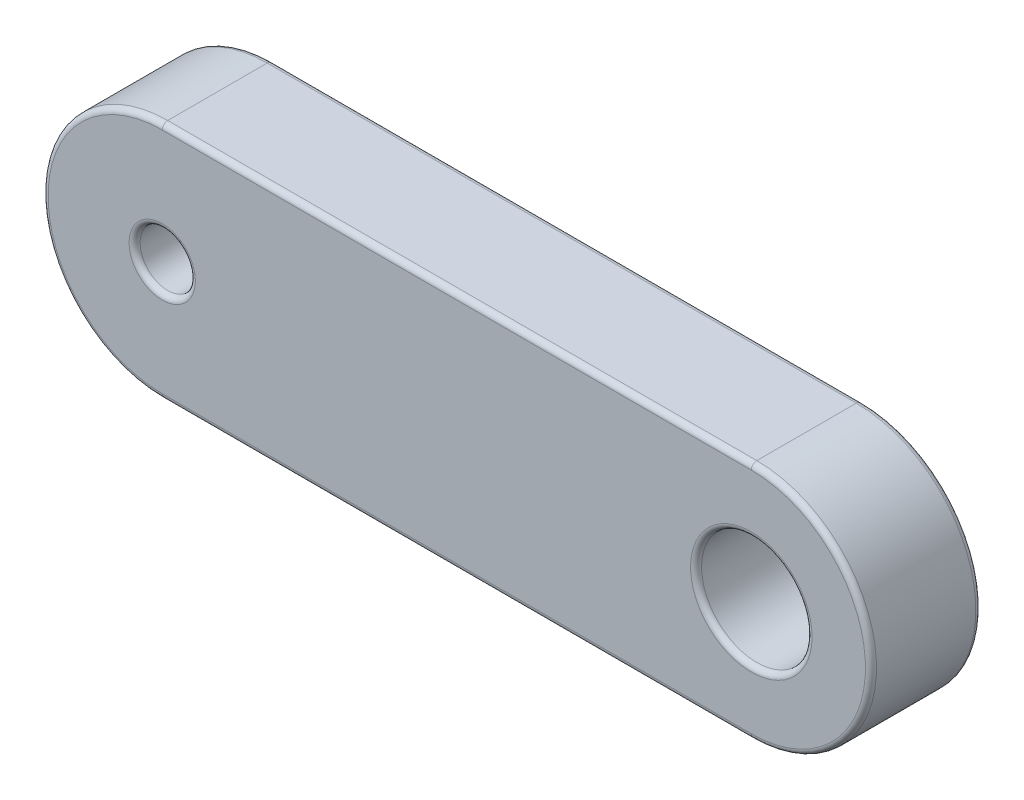
ISO-10303-21;
HEADER;
FILE_DESCRIPTION(('STEP AP214'),'2;1');
FILE_NAME('part.step','',(''),(''),'','','');
FILE_SCHEMA(('AUTOMOTIVE_DESIGN { 1 0 10303 214 1 1 1 1 }'));
ENDSEC;
DATA;
#1=APPLICATION_CONTEXT('core data for automotive mechanical design processes');
#2=APPLICATION_PROTOCOL_DEFINITION('international standard','automotive_design',2000,#1);
#3=PRODUCT_CONTEXT('',#1,'mechanical');
#4=PRODUCT('Part','Part','',(#3));
#5=PRODUCT_RELATED_PRODUCT_CATEGORY('part','',(#4));
#6=PRODUCT_DEFINITION_FORMATION('','',#4);
#7=PRODUCT_DEFINITION_CONTEXT('part definition',#1,'design');
#8=PRODUCT_DEFINITION('design','',#6,#7);
#9=PRODUCT_DEFINITION_SHAPE('','',#8);
#10=(LENGTH_UNIT() NAMED_UNIT(*) SI_UNIT(.MILLI.,.METRE.));
#11=(NAMED_UNIT(*) PLANE_ANGLE_UNIT() SI_UNIT($,.RADIAN.));
#12=(NAMED_UNIT(*) SI_UNIT($,.STERADIAN.) SOLID_ANGLE_UNIT());
#13=UNCERTAINTY_MEASURE_WITH_UNIT(LENGTH_MEASURE(1.E-05),#10,'distance_accuracy_value','');
#14=(GEOMETRIC_REPRESENTATION_CONTEXT(3) GLOBAL_UNCERTAINTY_ASSIGNED_CONTEXT((#13)) GLOBAL_UNIT_ASSIGNED_CONTEXT((#10,
#11,#12)) REPRESENTATION_CONTEXT('',''));
#15=CARTESIAN_POINT('',(0.,0.,0.));
#16=DIRECTION('',(0.,0.,1.));
#17=DIRECTION('',(1.,0.,0.));
#18=AXIS2_PLACEMENT_3D('',#15,#16,#17);
#19=CARTESIAN_POINT('',(-8.,0.,1.5));
#20=DIRECTION('',(0.,0.,1.));
#21=DIRECTION('',(1.,0.,0.));
#22=AXIS2_PLACEMENT_3D('',#19,#20,#21);
#23=PLANE('',#22);
#24=CARTESIAN_POINT('',(8.,0.,1.5));
#25=DIRECTION('',(0.,0.,1.));
#26=DIRECTION('',(1.,0.,0.));
#27=AXIS2_PLACEMENT_3D('',#24,#25,#26);
#28=CIRCLE('',#27,1.65);
#29=CARTESIAN_POINT('',(9.65,0.,1.5));
#30=VERTEX_POINT('',#29);
#31=EDGE_CURVE('E11',#30,#30,#28,.F.);
#32=ORIENTED_EDGE('',*,*,#31,.T.);
#33=EDGE_LOOP('',(#32));
#34=FACE_BOUND('',#33,.T.);
#35=CARTESIAN_POINT('',(8.,0.,1.5));
#36=DIRECTION('',(0.,0.,1.));
#37=DIRECTION('',(1.,0.,0.));
#38=AXIS2_PLACEMENT_3D('',#35,#36,#37);
#39=CIRCLE('',#38,3.1);
#40=CARTESIAN_POINT('',(8.,-3.1,1.5));
#41=VERTEX_POINT('',#40);
#42=CARTESIAN_POINT('',(8.,3.1,1.5));
#43=VERTEX_POINT('',#42);
#44=EDGE_CURVE('E57',#41,#43,#39,.T.);
#45=ORIENTED_EDGE('',*,*,#44,.T.);
#46=DIRECTION('',(-1.,0.,0.));
#47=VECTOR('',#46,1.);
#48=CARTESIAN_POINT('',(-8.,3.1,1.5));
#49=LINE('',#48,#47);
#50=CARTESIAN_POINT('',(-8.,3.1,1.5));
#51=VERTEX_POINT('',#50);
#52=EDGE_CURVE('E49',#43,#51,#49,.T.);
#53=ORIENTED_EDGE('',*,*,#52,.T.);
#54=CARTESIAN_POINT('',(-8.,0.,1.5));
#55=DIRECTION('',(0.,0.,1.));
#56=DIRECTION('',(1.,0.,0.));
#57=AXIS2_PLACEMENT_3D('',#54,#55,#56);
#58=CIRCLE('',#57,3.1);
#59=CARTESIAN_POINT('',(-8.,-3.1,1.5));
#60=VERTEX_POINT('',#59);
#61=EDGE_CURVE('E194',#51,#60,#58,.T.);
#62=ORIENTED_EDGE('',*,*,#61,.T.);
#63=DIRECTION('',(1.,0.,0.));
#64=VECTOR('',#63,1.);
#65=CARTESIAN_POINT('',(8.,-3.1,1.5));
#66=LINE('',#65,#64);
#67=EDGE_CURVE('E62',#60,#41,#66,.T.);
#68=ORIENTED_EDGE('',*,*,#67,.T.);
#69=EDGE_LOOP('',(#45,#53,#62,#68));
#70=FACE_BOUND('',#69,.T.);
#71=CARTESIAN_POINT('',(-8.,0.,1.5));
#72=DIRECTION('',(0.,0.,1.));
#73=DIRECTION('',(1.,0.,0.));
#74=AXIS2_PLACEMENT_3D('',#71,#72,#73);
#75=CIRCLE('',#74,0.9);
#76=CARTESIAN_POINT('',(-7.1,0.,1.5));
#77=VERTEX_POINT('',#76);
#78=EDGE_CURVE('E190',#77,#77,#75,.F.);
#79=ORIENTED_EDGE('',*,*,#78,.T.);
#80=EDGE_LOOP('',(#79));
#81=FACE_BOUND('',#80,.T.);
#82=ADVANCED_FACE('F39',(#34,#70,#81),#23,.T.);
#83=CARTESIAN_POINT('',(-8.,0.,-1.5));
#84=DIRECTION('',(0.,0.,1.));
#85=DIRECTION('',(1.,0.,0.));
#86=AXIS2_PLACEMENT_3D('',#83,#84,#85);
#87=PLANE('',#86);
#88=CARTESIAN_POINT('',(8.,0.,-1.5));
#89=DIRECTION('',(0.,0.,1.));
#90=DIRECTION('',(1.,0.,0.));
#91=AXIS2_PLACEMENT_3D('',#88,#89,#90);
#92=CIRCLE('',#91,1.65);
#93=CARTESIAN_POINT('',(9.65,0.,-1.5));
#94=VERTEX_POINT('',#93);
#95=EDGE_CURVE('E142',#94,#94,#92,.T.);
#96=ORIENTED_EDGE('',*,*,#95,.T.);
#97=EDGE_LOOP('',(#96));
#98=FACE_BOUND('',#97,.T.);
#99=CARTESIAN_POINT('',(-8.,0.,-1.5));
#100=DIRECTION('',(0.,0.,1.));
#101=DIRECTION('',(1.,0.,0.));
#102=AXIS2_PLACEMENT_3D('',#99,#100,#101);
#103=CIRCLE('',#102,0.9);
#104=CARTESIAN_POINT('',(-7.1,0.,-1.5));
#105=VERTEX_POINT('',#104);
#106=EDGE_CURVE('E137',#105,#105,#103,.T.);
#107=ORIENTED_EDGE('',*,*,#106,.T.);
#108=EDGE_LOOP('',(#107));
#109=FACE_BOUND('',#108,.T.);
#110=CARTESIAN_POINT('',(8.,0.,-1.5));
#111=DIRECTION('',(0.,0.,1.));
#112=DIRECTION('',(1.,0.,0.));
#113=AXIS2_PLACEMENT_3D('',#110,#111,#112);
#114=CIRCLE('',#113,3.1);
#115=CARTESIAN_POINT('',(8.,3.1,-1.5));
#116=VERTEX_POINT('',#115);
#117=CARTESIAN_POINT('',(8.,-3.1,-1.5));
#118=VERTEX_POINT('',#117);
#119=EDGE_CURVE('E135',#116,#118,#114,.F.);
#120=ORIENTED_EDGE('',*,*,#119,.T.);
#121=DIRECTION('',(1.,0.,0.));
#122=VECTOR('',#121,1.);
#123=CARTESIAN_POINT('',(-8.,-3.1,-1.5));
#124=LINE('',#123,#122);
#125=CARTESIAN_POINT('',(-8.,-3.1,-1.5));
#126=VERTEX_POINT('',#125);
#127=EDGE_CURVE('E112',#118,#126,#124,.F.);
#128=ORIENTED_EDGE('',*,*,#127,.T.);
#129=CARTESIAN_POINT('',(-8.,0.,-1.5));
#130=DIRECTION('',(0.,0.,1.));
#131=DIRECTION('',(1.,0.,0.));
#132=AXIS2_PLACEMENT_3D('',#129,#130,#131);
#133=CIRCLE('',#132,3.1);
#134=CARTESIAN_POINT('',(-8.,3.1,-1.5));
#135=VERTEX_POINT('',#134);
#136=EDGE_CURVE('E123',#126,#135,#133,.F.);
#137=ORIENTED_EDGE('',*,*,#136,.T.);
#138=DIRECTION('',(-1.,0.,0.));
#139=VECTOR('',#138,1.);
#140=CARTESIAN_POINT('',(-8.,3.1,-1.5));
#141=LINE('',#140,#139);
#142=EDGE_CURVE('E130',#135,#116,#141,.F.);
#143=ORIENTED_EDGE('',*,*,#142,.T.);
#144=EDGE_LOOP('',(#120,#128,#137,#143));
#145=FACE_BOUND('',#144,.T.);
#146=ADVANCED_FACE('F133',(#98,#109,#145),#87,.F.);
#147=CARTESIAN_POINT('',(-8.,0.,1.5));
#148=DIRECTION('',(0.,0.,-1.));
#149=DIRECTION('',(-1.,0.,0.));
#150=AXIS2_PLACEMENT_3D('',#147,#148,#149);
#151=CYLINDRICAL_SURFACE('',#150,3.25);
#152=DIRECTION('',(0.,0.,-1.));
#153=VECTOR('',#152,1.);
#154=CARTESIAN_POINT('',(-8.,3.25,1.5));
#155=LINE('',#154,#153);
#156=CARTESIAN_POINT('',(-8.,3.25,1.35));
#157=VERTEX_POINT('',#156);
#158=CARTESIAN_POINT('',(-8.,3.25,-1.35));
#159=VERTEX_POINT('',#158);
#160=EDGE_CURVE('E210',#157,#159,#155,.T.);
#161=ORIENTED_EDGE('',*,*,#160,.T.);
#162=CARTESIAN_POINT('',(-8.,0.,-1.35));
#163=DIRECTION('',(0.,0.,1.));
#164=DIRECTION('',(1.,0.,0.));
#165=AXIS2_PLACEMENT_3D('',#162,#163,#164);
#166=CIRCLE('',#165,3.25);
#167=CARTESIAN_POINT('',(-8.,-3.25,-1.35));
#168=VERTEX_POINT('',#167);
#169=EDGE_CURVE('E187',#159,#168,#166,.T.);
#170=ORIENTED_EDGE('',*,*,#169,.T.);
#171=DIRECTION('',(0.,0.,-1.));
#172=VECTOR('',#171,1.);
#173=CARTESIAN_POINT('',(-8.,-3.25,1.5));
#174=LINE('',#173,#172);
#175=CARTESIAN_POINT('',(-8.,-3.25,1.35));
#176=VERTEX_POINT('',#175);
#177=EDGE_CURVE('E131',#176,#168,#174,.T.);
#178=ORIENTED_EDGE('',*,*,#177,.F.);
#179=CARTESIAN_POINT('',(-8.,0.,1.35));
#180=DIRECTION('',(0.,0.,1.));
#181=DIRECTION('',(1.,0.,0.));
#182=AXIS2_PLACEMENT_3D('',#179,#180,#181);
#183=CIRCLE('',#182,3.25);
#184=EDGE_CURVE('E184',#176,#157,#183,.F.);
#185=ORIENTED_EDGE('',*,*,#184,.T.);
#186=EDGE_LOOP('',(#161,#170,#178,#185));
#187=FACE_BOUND('',#186,.T.);
#188=ADVANCED_FACE('F240',(#187),#151,.T.);
#189=CARTESIAN_POINT('',(-8.,-3.25,1.5));
#190=DIRECTION('',(0.,1.,0.));
#191=DIRECTION('',(-1.,0.,0.));
#192=AXIS2_PLACEMENT_3D('',#189,#190,#191);
#193=PLANE('',#192);
#194=ORIENTED_EDGE('',*,*,#177,.T.);
#195=DIRECTION('',(1.,0.,0.));
#196=VECTOR('',#195,1.);
#197=CARTESIAN_POINT('',(-8.,-3.25,-1.35));
#198=LINE('',#197,#196);
#199=CARTESIAN_POINT('',(8.,-3.25,-1.35));
#200=VERTEX_POINT('',#199);
#201=EDGE_CURVE('E115',#168,#200,#198,.T.);
#202=ORIENTED_EDGE('',*,*,#201,.T.);
#203=DIRECTION('',(0.,0.,-1.));
#204=VECTOR('',#203,1.);
#205=CARTESIAN_POINT('',(8.,-3.25,1.5));
#206=LINE('',#205,#204);
#207=CARTESIAN_POINT('',(8.,-3.25,1.35));
#208=VERTEX_POINT('',#207);
#209=EDGE_CURVE('E237',#208,#200,#206,.T.);
#210=ORIENTED_EDGE('',*,*,#209,.F.);
#211=DIRECTION('',(1.,0.,0.));
#212=VECTOR('',#211,1.);
#213=CARTESIAN_POINT('',(-8.,-3.25,1.35));
#214=LINE('',#213,#212);
#215=EDGE_CURVE('E166',#208,#176,#214,.F.);
#216=ORIENTED_EDGE('',*,*,#215,.T.);
#217=EDGE_LOOP('',(#194,#202,#210,#216));
#218=FACE_BOUND('',#217,.T.);
#219=ADVANCED_FACE('F235',(#218),#193,.F.);
#220=CARTESIAN_POINT('',(8.,0.,1.5));
#221=DIRECTION('',(0.,0.,-1.));
#222=DIRECTION('',(-1.,0.,0.));
#223=AXIS2_PLACEMENT_3D('',#220,#221,#222);
#224=CYLINDRICAL_SURFACE('',#223,3.25);
#225=ORIENTED_EDGE('',*,*,#209,.T.);
#226=CARTESIAN_POINT('',(8.,0.,-1.35));
#227=DIRECTION('',(0.,0.,1.));
#228=DIRECTION('',(1.,0.,0.));
#229=AXIS2_PLACEMENT_3D('',#226,#227,#228);
#230=CIRCLE('',#229,3.25);
#231=CARTESIAN_POINT('',(8.,3.25,-1.35));
#232=VERTEX_POINT('',#231);
#233=EDGE_CURVE('E174',#200,#232,#230,.T.);
#234=ORIENTED_EDGE('',*,*,#233,.T.);
#235=DIRECTION('',(0.,0.,-1.));
#236=VECTOR('',#235,1.);
#237=CARTESIAN_POINT('',(8.,3.25,1.5));
#238=LINE('',#237,#236);
#239=CARTESIAN_POINT('',(8.,3.25,1.35));
#240=VERTEX_POINT('',#239);
#241=EDGE_CURVE('E245',#240,#232,#238,.T.);
#242=ORIENTED_EDGE('',*,*,#241,.F.);
#243=CARTESIAN_POINT('',(8.,0.,1.35));
#244=DIRECTION('',(0.,0.,1.));
#245=DIRECTION('',(1.,0.,0.));
#246=AXIS2_PLACEMENT_3D('',#243,#244,#245);
#247=CIRCLE('',#246,3.25);
#248=EDGE_CURVE('E171',#240,#208,#247,.F.);
#249=ORIENTED_EDGE('',*,*,#248,.T.);
#250=EDGE_LOOP('',(#225,#234,#242,#249));
#251=FACE_BOUND('',#250,.T.);
#252=ADVANCED_FACE('F259',(#251),#224,.T.);
#253=CARTESIAN_POINT('',(-8.,3.25,1.5));
#254=DIRECTION('',(0.,-1.,0.));
#255=DIRECTION('',(1.,0.,0.));
#256=AXIS2_PLACEMENT_3D('',#253,#254,#255);
#257=PLANE('',#256);
#258=ORIENTED_EDGE('',*,*,#241,.T.);
#259=DIRECTION('',(-1.,0.,0.));
#260=VECTOR('',#259,1.);
#261=CARTESIAN_POINT('',(-8.,3.25,-1.35));
#262=LINE('',#261,#260);
#263=EDGE_CURVE('E181',#232,#159,#262,.T.);
#264=ORIENTED_EDGE('',*,*,#263,.T.);
#265=ORIENTED_EDGE('',*,*,#160,.F.);
#266=DIRECTION('',(-1.,0.,0.));
#267=VECTOR('',#266,1.);
#268=CARTESIAN_POINT('',(8.,3.25,1.35));
#269=LINE('',#268,#267);
#270=EDGE_CURVE('E177',#157,#240,#269,.F.);
#271=ORIENTED_EDGE('',*,*,#270,.T.);
#272=EDGE_LOOP('',(#258,#264,#265,#271));
#273=FACE_BOUND('',#272,.T.);
#274=ADVANCED_FACE('F265',(#273),#257,.F.);
#275=CARTESIAN_POINT('',(-8.,0.,1.5));
#276=DIRECTION('',(0.,0.,-1.));
#277=DIRECTION('',(-1.,0.,0.));
#278=AXIS2_PLACEMENT_3D('',#275,#276,#277);
#279=CYLINDRICAL_SURFACE('',#278,0.75);
#280=CARTESIAN_POINT('',(-8.,0.,-1.35));
#281=DIRECTION('',(0.,0.,1.));
#282=DIRECTION('',(1.,0.,0.));
#283=AXIS2_PLACEMENT_3D('',#280,#281,#282);
#284=CIRCLE('',#283,0.75);
#285=CARTESIAN_POINT('',(-7.25,0.,-1.35));
#286=VERTEX_POINT('',#285);
#287=EDGE_CURVE('E162',#286,#286,#284,.F.);
#288=ORIENTED_EDGE('',*,*,#287,.T.);
#289=EDGE_LOOP('',(#288));
#290=FACE_BOUND('',#289,.T.);
#291=CARTESIAN_POINT('',(-8.,0.,1.35));
#292=DIRECTION('',(0.,0.,1.));
#293=DIRECTION('',(1.,0.,0.));
#294=AXIS2_PLACEMENT_3D('',#291,#292,#293);
#295=CIRCLE('',#294,0.75);
#296=CARTESIAN_POINT('',(-7.25,0.,1.35));
#297=VERTEX_POINT('',#296);
#298=EDGE_CURVE('E158',#297,#297,#295,.T.);
#299=ORIENTED_EDGE('',*,*,#298,.T.);
#300=EDGE_LOOP('',(#299));
#301=FACE_BOUND('',#300,.T.);
#302=ADVANCED_FACE('F281',(#290,#301),#279,.F.);
#303=CARTESIAN_POINT('',(8.,0.,1.5));
#304=DIRECTION('',(0.,0.,-1.));
#305=DIRECTION('',(-1.,0.,0.));
#306=AXIS2_PLACEMENT_3D('',#303,#304,#305);
#307=CYLINDRICAL_SURFACE('',#306,1.5);
#308=CARTESIAN_POINT('',(8.,0.,-1.35));
#309=DIRECTION('',(0.,0.,1.));
#310=DIRECTION('',(1.,0.,0.));
#311=AXIS2_PLACEMENT_3D('',#308,#309,#310);
#312=CIRCLE('',#311,1.5);
#313=CARTESIAN_POINT('',(9.5,0.,-1.35));
#314=VERTEX_POINT('',#313);
#315=EDGE_CURVE('E154',#314,#314,#312,.F.);
#316=ORIENTED_EDGE('',*,*,#315,.T.);
#317=EDGE_LOOP('',(#316));
#318=FACE_BOUND('',#317,.T.);
#319=CARTESIAN_POINT('',(8.,0.,1.35));
#320=DIRECTION('',(0.,0.,1.));
#321=DIRECTION('',(1.,0.,0.));
#322=AXIS2_PLACEMENT_3D('',#319,#320,#321);
#323=CIRCLE('',#322,1.5);
#324=CARTESIAN_POINT('',(9.5,0.,1.35));
#325=VERTEX_POINT('',#324);
#326=EDGE_CURVE('E150',#325,#325,#323,.T.);
#327=ORIENTED_EDGE('',*,*,#326,.T.);
#328=EDGE_LOOP('',(#327));
#329=FACE_BOUND('',#328,.T.);
#330=ADVANCED_FACE('F283',(#318,#329),#307,.F.);
#331=CARTESIAN_POINT('',(8.,0.,-1.35));
#332=DIRECTION('',(0.,0.,1.));
#333=DIRECTION('',(1.,0.,0.));
#334=AXIS2_PLACEMENT_3D('',#331,#332,#333);
#335=TOROIDAL_SURFACE('',#334,1.65,0.15);
#336=ORIENTED_EDGE('',*,*,#315,.F.);
#337=EDGE_LOOP('',(#336));
#338=FACE_BOUND('',#337,.T.);
#339=ORIENTED_EDGE('',*,*,#95,.F.);
#340=EDGE_LOOP('',(#339));
#341=FACE_BOUND('',#340,.T.);
#342=ADVANCED_FACE('F290',(#338,#341),#335,.T.);
#343=CARTESIAN_POINT('',(-8.,0.,-1.35));
#344=DIRECTION('',(0.,0.,1.));
#345=DIRECTION('',(1.,0.,0.));
#346=AXIS2_PLACEMENT_3D('',#343,#344,#345);
#347=TOROIDAL_SURFACE('',#346,0.9,0.15);
#348=ORIENTED_EDGE('',*,*,#287,.F.);
#349=EDGE_LOOP('',(#348));
#350=FACE_BOUND('',#349,.T.);
#351=ORIENTED_EDGE('',*,*,#106,.F.);
#352=EDGE_LOOP('',(#351));
#353=FACE_BOUND('',#352,.T.);
#354=ADVANCED_FACE('F306',(#350,#353),#347,.T.);
#355=CARTESIAN_POINT('',(-8.,3.1,-1.35));
#356=DIRECTION('',(-1.,0.,0.));
#357=DIRECTION('',(0.,-1.,0.));
#358=AXIS2_PLACEMENT_3D('',#355,#356,#357);
#359=CYLINDRICAL_SURFACE('',#358,0.15);
#360=CARTESIAN_POINT('',(8.,3.1,-1.35));
#361=DIRECTION('',(1.,0.,0.));
#362=DIRECTION('',(0.,0.,-1.));
#363=AXIS2_PLACEMENT_3D('',#360,#361,#362);
#364=CIRCLE('',#363,0.15);
#365=EDGE_CURVE('E119',#116,#232,#364,.T.);
#366=ORIENTED_EDGE('',*,*,#365,.F.);
#367=ORIENTED_EDGE('',*,*,#142,.F.);
#368=CARTESIAN_POINT('',(-8.,3.1,-1.35));
#369=DIRECTION('',(-1.,0.,0.));
#370=DIRECTION('',(0.,0.,1.));
#371=AXIS2_PLACEMENT_3D('',#368,#369,#370);
#372=CIRCLE('',#371,0.15);
#373=EDGE_CURVE('E126',#159,#135,#372,.T.);
#374=ORIENTED_EDGE('',*,*,#373,.F.);
#375=ORIENTED_EDGE('',*,*,#263,.F.);
#376=EDGE_LOOP('',(#366,#367,#374,#375));
#377=FACE_BOUND('',#376,.T.);
#378=ADVANCED_FACE('F252',(#377),#359,.T.);
#379=CARTESIAN_POINT('',(-8.,0.,-1.35));
#380=DIRECTION('',(0.,0.,1.));
#381=DIRECTION('',(1.,0.,0.));
#382=AXIS2_PLACEMENT_3D('',#379,#380,#381);
#383=TOROIDAL_SURFACE('',#382,3.1,0.15);
#384=ORIENTED_EDGE('',*,*,#373,.T.);
#385=ORIENTED_EDGE('',*,*,#136,.F.);
#386=CARTESIAN_POINT('',(-8.,-3.1,-1.35));
#387=DIRECTION('',(1.,0.,0.));
#388=DIRECTION('',(0.,0.,-1.));
#389=AXIS2_PLACEMENT_3D('',#386,#387,#388);
#390=CIRCLE('',#389,0.15);
#391=EDGE_CURVE('E108',#168,#126,#390,.T.);
#392=ORIENTED_EDGE('',*,*,#391,.F.);
#393=ORIENTED_EDGE('',*,*,#169,.F.);
#394=EDGE_LOOP('',(#384,#385,#392,#393));
#395=FACE_BOUND('',#394,.T.);
#396=ADVANCED_FACE('F124',(#395),#383,.T.);
#397=CARTESIAN_POINT('',(8.,0.,-1.35));
#398=DIRECTION('',(0.,0.,1.));
#399=DIRECTION('',(1.,0.,0.));
#400=AXIS2_PLACEMENT_3D('',#397,#398,#399);
#401=TOROIDAL_SURFACE('',#400,3.1,0.15);
#402=ORIENTED_EDGE('',*,*,#365,.T.);
#403=ORIENTED_EDGE('',*,*,#233,.F.);
#404=CARTESIAN_POINT('',(8.,-3.1,-1.35));
#405=DIRECTION('',(-1.,0.,0.));
#406=DIRECTION('',(0.,0.,1.));
#407=AXIS2_PLACEMENT_3D('',#404,#405,#406);
#408=CIRCLE('',#407,0.15);
#409=EDGE_CURVE('E120',#118,#200,#408,.T.);
#410=ORIENTED_EDGE('',*,*,#409,.F.);
#411=ORIENTED_EDGE('',*,*,#119,.F.);
#412=EDGE_LOOP('',(#402,#403,#410,#411));
#413=FACE_BOUND('',#412,.T.);
#414=ADVANCED_FACE('F255',(#413),#401,.T.);
#415=CARTESIAN_POINT('',(-8.,-3.1,-1.35));
#416=DIRECTION('',(1.,0.,0.));
#417=DIRECTION('',(0.,1.,0.));
#418=AXIS2_PLACEMENT_3D('',#415,#416,#417);
#419=CYLINDRICAL_SURFACE('',#418,0.15);
#420=ORIENTED_EDGE('',*,*,#391,.T.);
#421=ORIENTED_EDGE('',*,*,#127,.F.);
#422=ORIENTED_EDGE('',*,*,#409,.T.);
#423=ORIENTED_EDGE('',*,*,#201,.F.);
#424=EDGE_LOOP('',(#420,#421,#422,#423));
#425=FACE_BOUND('',#424,.T.);
#426=ADVANCED_FACE('F110',(#425),#419,.T.);
#427=CARTESIAN_POINT('',(8.,0.,1.35));
#428=DIRECTION('',(0.,0.,1.));
#429=DIRECTION('',(1.,0.,0.));
#430=AXIS2_PLACEMENT_3D('',#427,#428,#429);
#431=TOROIDAL_SURFACE('',#430,1.65,0.15);
#432=ORIENTED_EDGE('',*,*,#31,.F.);
#433=EDGE_LOOP('',(#432));
#434=FACE_BOUND('',#433,.T.);
#435=ORIENTED_EDGE('',*,*,#326,.F.);
#436=EDGE_LOOP('',(#435));
#437=FACE_BOUND('',#436,.T.);
#438=ADVANCED_FACE('F313',(#434,#437),#431,.T.);
#439=CARTESIAN_POINT('',(-8.,-3.1,1.35));
#440=DIRECTION('',(-1.,0.,0.));
#441=DIRECTION('',(0.,-1.,0.));
#442=AXIS2_PLACEMENT_3D('',#439,#440,#441);
#443=CYLINDRICAL_SURFACE('',#442,0.15);
#444=CARTESIAN_POINT('',(-8.,-3.1,1.35));
#445=DIRECTION('',(-1.,0.,0.));
#446=DIRECTION('',(0.,0.,1.));
#447=AXIS2_PLACEMENT_3D('',#444,#445,#446);
#448=CIRCLE('',#447,0.15);
#449=EDGE_CURVE('E216',#176,#60,#448,.T.);
#450=ORIENTED_EDGE('',*,*,#449,.F.);
#451=ORIENTED_EDGE('',*,*,#215,.F.);
#452=CARTESIAN_POINT('',(8.,-3.1,1.35));
#453=DIRECTION('',(1.,0.,0.));
#454=DIRECTION('',(0.,0.,-1.));
#455=AXIS2_PLACEMENT_3D('',#452,#453,#454);
#456=CIRCLE('',#455,0.15);
#457=EDGE_CURVE('E43',#41,#208,#456,.T.);
#458=ORIENTED_EDGE('',*,*,#457,.F.);
#459=ORIENTED_EDGE('',*,*,#67,.F.);
#460=EDGE_LOOP('',(#450,#451,#458,#459));
#461=FACE_BOUND('',#460,.T.);
#462=ADVANCED_FACE('F230',(#461),#443,.T.);
#463=CARTESIAN_POINT('',(8.,0.,1.35));
#464=DIRECTION('',(0.,0.,1.));
#465=DIRECTION('',(1.,0.,0.));
#466=AXIS2_PLACEMENT_3D('',#463,#464,#465);
#467=TOROIDAL_SURFACE('',#466,3.1,0.15);
#468=ORIENTED_EDGE('',*,*,#457,.T.);
#469=ORIENTED_EDGE('',*,*,#248,.F.);
#470=CARTESIAN_POINT('',(8.,3.1,1.35));
#471=DIRECTION('',(-1.,0.,0.));
#472=DIRECTION('',(0.,0.,1.));
#473=AXIS2_PLACEMENT_3D('',#470,#471,#472);
#474=CIRCLE('',#473,0.15);
#475=EDGE_CURVE('E214',#43,#240,#474,.T.);
#476=ORIENTED_EDGE('',*,*,#475,.F.);
#477=ORIENTED_EDGE('',*,*,#44,.F.);
#478=EDGE_LOOP('',(#468,#469,#476,#477));
#479=FACE_BOUND('',#478,.T.);
#480=ADVANCED_FACE('F227',(#479),#467,.T.);
#481=CARTESIAN_POINT('',(-8.,0.,1.35));
#482=DIRECTION('',(0.,0.,1.));
#483=DIRECTION('',(1.,0.,0.));
#484=AXIS2_PLACEMENT_3D('',#481,#482,#483);
#485=TOROIDAL_SURFACE('',#484,3.1,0.15);
#486=ORIENTED_EDGE('',*,*,#449,.T.);
#487=ORIENTED_EDGE('',*,*,#61,.F.);
#488=CARTESIAN_POINT('',(-8.,3.1,1.35));
#489=DIRECTION('',(1.,0.,0.));
#490=DIRECTION('',(0.,0.,-1.));
#491=AXIS2_PLACEMENT_3D('',#488,#489,#490);
#492=CIRCLE('',#491,0.15);
#493=EDGE_CURVE('E211',#157,#51,#492,.T.);
#494=ORIENTED_EDGE('',*,*,#493,.F.);
#495=ORIENTED_EDGE('',*,*,#184,.F.);
#496=EDGE_LOOP('',(#486,#487,#494,#495));
#497=FACE_BOUND('',#496,.T.);
#498=ADVANCED_FACE('F270',(#497),#485,.T.);
#499=CARTESIAN_POINT('',(-8.,3.1,1.35));
#500=DIRECTION('',(1.,0.,0.));
#501=DIRECTION('',(0.,1.,0.));
#502=AXIS2_PLACEMENT_3D('',#499,#500,#501);
#503=CYLINDRICAL_SURFACE('',#502,0.15);
#504=ORIENTED_EDGE('',*,*,#475,.T.);
#505=ORIENTED_EDGE('',*,*,#270,.F.);
#506=ORIENTED_EDGE('',*,*,#493,.T.);
#507=ORIENTED_EDGE('',*,*,#52,.F.);
#508=EDGE_LOOP('',(#504,#505,#506,#507));
#509=FACE_BOUND('',#508,.T.);
#510=ADVANCED_FACE('F268',(#509),#503,.T.);
#511=CARTESIAN_POINT('',(-8.,0.,1.35));
#512=DIRECTION('',(0.,0.,1.));
#513=DIRECTION('',(1.,0.,0.));
#514=AXIS2_PLACEMENT_3D('',#511,#512,#513);
#515=TOROIDAL_SURFACE('',#514,0.9,0.15);
#516=ORIENTED_EDGE('',*,*,#78,.F.);
#517=EDGE_LOOP('',(#516));
#518=FACE_BOUND('',#517,.T.);
#519=ORIENTED_EDGE('',*,*,#298,.F.);
#520=EDGE_LOOP('',(#519));
#521=FACE_BOUND('',#520,.T.);
#522=ADVANCED_FACE('F41',(#518,#521),#515,.T.);
#523=CLOSED_SHELL('',(#82,#146,#188,#219,#252,#274,#302,#330,#342,#354,#378,#396,#414,#426,#438,
#462,#480,#498,#510,#522));
#524=MANIFOLD_SOLID_BREP('B2',#523);
#525=ADVANCED_BREP_SHAPE_REPRESENTATION('',(#18,#524),#14);
#526=SHAPE_DEFINITION_REPRESENTATION(#9,#525);
ENDSEC;
END-ISO-10303-21;
